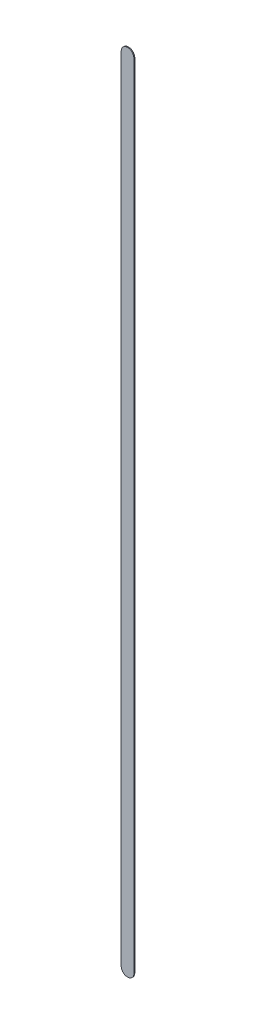
ISO-10303-21;
HEADER;
FILE_DESCRIPTION(('STEP AP214'),'2;1');
FILE_NAME('part.step','',(''),(''),'','','');
FILE_SCHEMA(('AUTOMOTIVE_DESIGN { 1 0 10303 214 1 1 1 1 }'));
ENDSEC;
DATA;
#1=APPLICATION_CONTEXT('core data for automotive mechanical design processes');
#2=APPLICATION_PROTOCOL_DEFINITION('international standard','automotive_design',2000,#1);
#3=PRODUCT_CONTEXT('',#1,'mechanical');
#4=PRODUCT('Part','Part','',(#3));
#5=PRODUCT_RELATED_PRODUCT_CATEGORY('part','',(#4));
#6=PRODUCT_DEFINITION_FORMATION('','',#4);
#7=PRODUCT_DEFINITION_CONTEXT('part definition',#1,'design');
#8=PRODUCT_DEFINITION('design','',#6,#7);
#9=PRODUCT_DEFINITION_SHAPE('','',#8);
#10=(LENGTH_UNIT() NAMED_UNIT(*) SI_UNIT(.MILLI.,.METRE.));
#11=(NAMED_UNIT(*) PLANE_ANGLE_UNIT() SI_UNIT($,.RADIAN.));
#12=(NAMED_UNIT(*) SI_UNIT($,.STERADIAN.) SOLID_ANGLE_UNIT());
#13=UNCERTAINTY_MEASURE_WITH_UNIT(LENGTH_MEASURE(1.E-05),#10,'distance_accuracy_value','');
#14=(GEOMETRIC_REPRESENTATION_CONTEXT(3) GLOBAL_UNCERTAINTY_ASSIGNED_CONTEXT((#13)) GLOBAL_UNIT_ASSIGNED_CONTEXT((#10,
#11,#12)) REPRESENTATION_CONTEXT('',''));
#15=CARTESIAN_POINT('',(0.,0.,0.));
#16=DIRECTION('',(0.,0.,1.));
#17=DIRECTION('',(1.,0.,0.));
#18=AXIS2_PLACEMENT_3D('',#15,#16,#17);
#19=CARTESIAN_POINT('',(179.701,-121.285,0.));
#20=DIRECTION('',(0.,0.,1.));
#21=DIRECTION('',(1.,0.,0.));
#22=AXIS2_PLACEMENT_3D('',#19,#20,#21);
#23=PLANE('',#22);
#24=DIRECTION('',(0.,1.,0.));
#25=VECTOR('',#24,1.);
#26=CARTESIAN_POINT('',(179.701,-121.285,0.));
#27=LINE('',#26,#25);
#28=CARTESIAN_POINT('',(179.701,-121.285,0.));
#29=VERTEX_POINT('',#28);
#30=CARTESIAN_POINT('',(179.701,-90.043,0.));
#31=VERTEX_POINT('',#30);
#32=EDGE_CURVE('E69',#29,#31,#27,.T.);
#33=ORIENTED_EDGE('',*,*,#32,.T.);
#34=CARTESIAN_POINT('',(179.451,-90.043,0.));
#35=DIRECTION('',(0.,0.,1.));
#36=DIRECTION('',(1.,0.,0.));
#37=AXIS2_PLACEMENT_3D('',#34,#35,#36);
#38=CIRCLE('',#37,0.25);
#39=CARTESIAN_POINT('',(179.201,-90.043,0.));
#40=VERTEX_POINT('',#39);
#41=EDGE_CURVE('E66',#31,#40,#38,.T.);
#42=ORIENTED_EDGE('',*,*,#41,.T.);
#43=DIRECTION('',(0.,-1.,0.));
#44=VECTOR('',#43,1.);
#45=CARTESIAN_POINT('',(179.201,-90.043,0.));
#46=LINE('',#45,#44);
#47=CARTESIAN_POINT('',(179.201,-121.285,0.));
#48=VERTEX_POINT('',#47);
#49=EDGE_CURVE('E54',#40,#48,#46,.T.);
#50=ORIENTED_EDGE('',*,*,#49,.T.);
#51=CARTESIAN_POINT('',(179.451,-121.285,0.));
#52=DIRECTION('',(0.,0.,1.));
#53=DIRECTION('',(-1.,0.,0.));
#54=AXIS2_PLACEMENT_3D('',#51,#52,#53);
#55=CIRCLE('',#54,0.25);
#56=EDGE_CURVE('E11',#48,#29,#55,.T.);
#57=ORIENTED_EDGE('',*,*,#56,.T.);
#58=EDGE_LOOP('',(#33,#42,#50,#57));
#59=FACE_BOUND('',#58,.T.);
#60=ADVANCED_FACE('F17',(#59),#23,.T.);
#61=CARTESIAN_POINT('',(179.701,-121.285,-0.035));
#62=DIRECTION('',(0.,0.,1.));
#63=DIRECTION('',(1.,0.,0.));
#64=AXIS2_PLACEMENT_3D('',#61,#62,#63);
#65=PLANE('',#64);
#66=CARTESIAN_POINT('',(179.451,-121.285,-0.035));
#67=DIRECTION('',(0.,0.,1.));
#68=DIRECTION('',(-1.,0.,0.));
#69=AXIS2_PLACEMENT_3D('',#66,#67,#68);
#70=CIRCLE('',#69,0.25);
#71=CARTESIAN_POINT('',(179.201,-121.285,-0.035));
#72=VERTEX_POINT('',#71);
#73=CARTESIAN_POINT('',(179.701,-121.285,-0.035));
#74=VERTEX_POINT('',#73);
#75=EDGE_CURVE('E20',#72,#74,#70,.T.);
#76=ORIENTED_EDGE('',*,*,#75,.F.);
#77=DIRECTION('',(0.,-1.,0.));
#78=VECTOR('',#77,1.);
#79=CARTESIAN_POINT('',(179.201,-90.043,-0.035));
#80=LINE('',#79,#78);
#81=CARTESIAN_POINT('',(179.201,-90.043,-0.035));
#82=VERTEX_POINT('',#81);
#83=EDGE_CURVE('E74',#82,#72,#80,.T.);
#84=ORIENTED_EDGE('',*,*,#83,.F.);
#85=CARTESIAN_POINT('',(179.451,-90.043,-0.035));
#86=DIRECTION('',(0.,0.,1.));
#87=DIRECTION('',(1.,0.,0.));
#88=AXIS2_PLACEMENT_3D('',#85,#86,#87);
#89=CIRCLE('',#88,0.25);
#90=CARTESIAN_POINT('',(179.701,-90.043,-0.035));
#91=VERTEX_POINT('',#90);
#92=EDGE_CURVE('E78',#91,#82,#89,.T.);
#93=ORIENTED_EDGE('',*,*,#92,.F.);
#94=DIRECTION('',(0.,1.,0.));
#95=VECTOR('',#94,1.);
#96=CARTESIAN_POINT('',(179.701,-121.285,-0.035));
#97=LINE('',#96,#95);
#98=EDGE_CURVE('E97',#74,#91,#97,.T.);
#99=ORIENTED_EDGE('',*,*,#98,.F.);
#100=EDGE_LOOP('',(#76,#84,#93,#99));
#101=FACE_BOUND('',#100,.T.);
#102=ADVANCED_FACE('F156',(#101),#65,.F.);
#103=CARTESIAN_POINT('',(179.451,-121.285,-0.035));
#104=DIRECTION('',(0.,0.,-1.));
#105=DIRECTION('',(-1.,0.,0.));
#106=AXIS2_PLACEMENT_3D('',#103,#104,#105);
#107=CYLINDRICAL_SURFACE('',#106,0.25);
#108=ORIENTED_EDGE('',*,*,#75,.T.);
#109=DIRECTION('',(0.,0.,1.));
#110=VECTOR('',#109,1.);
#111=CARTESIAN_POINT('',(179.701,-121.285,-0.035));
#112=LINE('',#111,#110);
#113=EDGE_CURVE('E85',#74,#29,#112,.T.);
#114=ORIENTED_EDGE('',*,*,#113,.T.);
#115=ORIENTED_EDGE('',*,*,#56,.F.);
#116=DIRECTION('',(0.,0.,1.));
#117=VECTOR('',#116,1.);
#118=CARTESIAN_POINT('',(179.201,-121.285,-0.035));
#119=LINE('',#118,#117);
#120=EDGE_CURVE('E61',#72,#48,#119,.T.);
#121=ORIENTED_EDGE('',*,*,#120,.F.);
#122=EDGE_LOOP('',(#108,#114,#115,#121));
#123=FACE_BOUND('',#122,.T.);
#124=ADVANCED_FACE('F148',(#123),#107,.T.);
#125=CARTESIAN_POINT('',(179.201,-90.043,-0.035));
#126=DIRECTION('',(1.,0.,0.));
#127=DIRECTION('',(0.,1.,0.));
#128=AXIS2_PLACEMENT_3D('',#125,#126,#127);
#129=PLANE('',#128);
#130=ORIENTED_EDGE('',*,*,#83,.T.);
#131=ORIENTED_EDGE('',*,*,#120,.T.);
#132=ORIENTED_EDGE('',*,*,#49,.F.);
#133=DIRECTION('',(0.,0.,1.));
#134=VECTOR('',#133,1.);
#135=CARTESIAN_POINT('',(179.201,-90.043,-0.035));
#136=LINE('',#135,#134);
#137=EDGE_CURVE('E59',#82,#40,#136,.T.);
#138=ORIENTED_EDGE('',*,*,#137,.F.);
#139=EDGE_LOOP('',(#130,#131,#132,#138));
#140=FACE_BOUND('',#139,.T.);
#141=ADVANCED_FACE('F57',(#140),#129,.F.);
#142=CARTESIAN_POINT('',(179.451,-90.043,-0.035));
#143=DIRECTION('',(0.,0.,-1.));
#144=DIRECTION('',(1.,0.,0.));
#145=AXIS2_PLACEMENT_3D('',#142,#143,#144);
#146=CYLINDRICAL_SURFACE('',#145,0.25);
#147=ORIENTED_EDGE('',*,*,#92,.T.);
#148=ORIENTED_EDGE('',*,*,#137,.T.);
#149=ORIENTED_EDGE('',*,*,#41,.F.);
#150=DIRECTION('',(0.,0.,1.));
#151=VECTOR('',#150,1.);
#152=CARTESIAN_POINT('',(179.701,-90.043,-0.035));
#153=LINE('',#152,#151);
#154=EDGE_CURVE('E92',#91,#31,#153,.T.);
#155=ORIENTED_EDGE('',*,*,#154,.F.);
#156=EDGE_LOOP('',(#147,#148,#149,#155));
#157=FACE_BOUND('',#156,.T.);
#158=ADVANCED_FACE('F76',(#157),#146,.T.);
#159=CARTESIAN_POINT('',(179.701,-121.285,-0.035));
#160=DIRECTION('',(-1.,0.,0.));
#161=DIRECTION('',(0.,0.,1.));
#162=AXIS2_PLACEMENT_3D('',#159,#160,#161);
#163=PLANE('',#162);
#164=ORIENTED_EDGE('',*,*,#98,.T.);
#165=ORIENTED_EDGE('',*,*,#154,.T.);
#166=ORIENTED_EDGE('',*,*,#32,.F.);
#167=ORIENTED_EDGE('',*,*,#113,.F.);
#168=EDGE_LOOP('',(#164,#165,#166,#167));
#169=FACE_BOUND('',#168,.T.);
#170=ADVANCED_FACE('F128',(#169),#163,.F.);
#171=CLOSED_SHELL('',(#60,#102,#124,#141,#158,#170));
#172=MANIFOLD_SOLID_BREP('B1',#171);
#173=ADVANCED_BREP_SHAPE_REPRESENTATION('',(#18,#172),#14);
#174=SHAPE_DEFINITION_REPRESENTATION(#9,#173);
ENDSEC;
END-ISO-10303-21;
